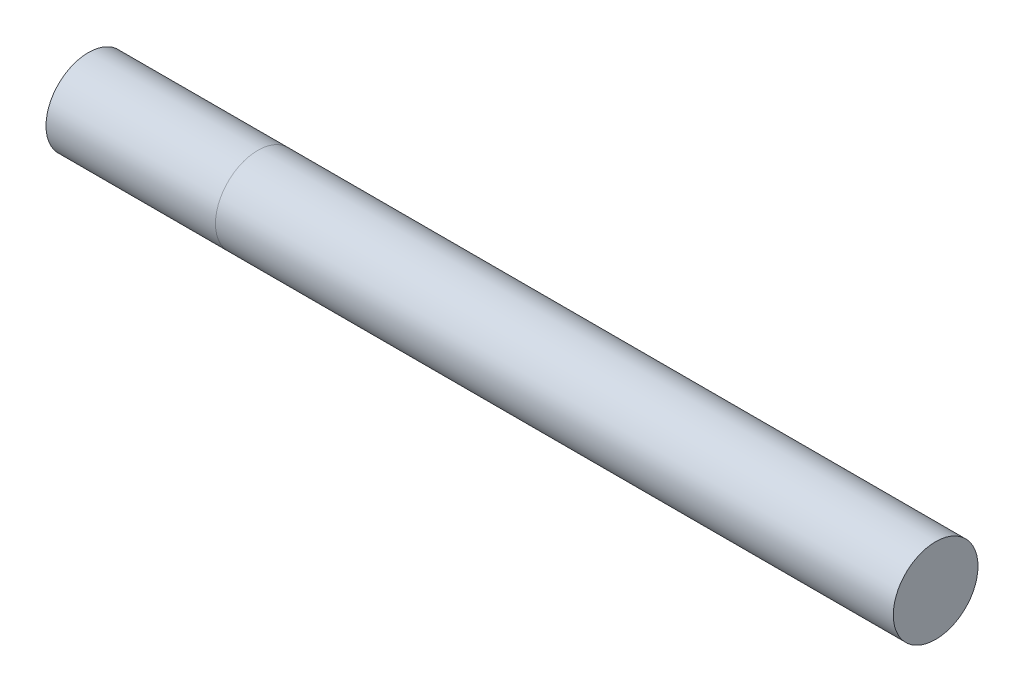
ISO-10303-21;
HEADER;
FILE_DESCRIPTION(('STEP AP214'),'2;1');
FILE_NAME('part.step','',(''),(''),'','','');
FILE_SCHEMA(('AUTOMOTIVE_DESIGN { 1 0 10303 214 1 1 1 1 }'));
ENDSEC;
DATA;
#1=APPLICATION_CONTEXT('core data for automotive mechanical design processes');
#2=APPLICATION_PROTOCOL_DEFINITION('international standard','automotive_design',2000,#1);
#3=PRODUCT_CONTEXT('',#1,'mechanical');
#4=PRODUCT('Part','Part','',(#3));
#5=PRODUCT_RELATED_PRODUCT_CATEGORY('part','',(#4));
#6=PRODUCT_DEFINITION_FORMATION('','',#4);
#7=PRODUCT_DEFINITION_CONTEXT('part definition',#1,'design');
#8=PRODUCT_DEFINITION('design','',#6,#7);
#9=PRODUCT_DEFINITION_SHAPE('','',#8);
#10=(LENGTH_UNIT() NAMED_UNIT(*) SI_UNIT(.MILLI.,.METRE.));
#11=(NAMED_UNIT(*) PLANE_ANGLE_UNIT() SI_UNIT($,.RADIAN.));
#12=(NAMED_UNIT(*) SI_UNIT($,.STERADIAN.) SOLID_ANGLE_UNIT());
#13=UNCERTAINTY_MEASURE_WITH_UNIT(LENGTH_MEASURE(1.E-05),#10,'distance_accuracy_value','');
#14=(GEOMETRIC_REPRESENTATION_CONTEXT(3) GLOBAL_UNCERTAINTY_ASSIGNED_CONTEXT((#13)) GLOBAL_UNIT_ASSIGNED_CONTEXT((#10,
#11,#12)) REPRESENTATION_CONTEXT('',''));
#15=CARTESIAN_POINT('',(0.,0.,0.));
#16=DIRECTION('',(0.,0.,1.));
#17=DIRECTION('',(1.,0.,0.));
#18=AXIS2_PLACEMENT_3D('',#15,#16,#17);
#19=CARTESIAN_POINT('',(250.,0.,0.));
#20=DIRECTION('',(-1.,0.,0.));
#21=DIRECTION('',(0.,0.,1.));
#22=AXIS2_PLACEMENT_3D('',#19,#20,#21);
#23=CYLINDRICAL_SURFACE('',#22,12.5);
#24=CARTESIAN_POINT('',(0.,0.,0.));
#25=DIRECTION('',(1.,0.,0.));
#26=DIRECTION('',(0.,0.,-1.));
#27=AXIS2_PLACEMENT_3D('',#24,#25,#26);
#28=CIRCLE('',#27,12.5);
#29=CARTESIAN_POINT('',(0.,0.,-12.5));
#30=VERTEX_POINT('',#29);
#31=EDGE_CURVE('E42',#30,#30,#28,.T.);
#32=ORIENTED_EDGE('',*,*,#31,.T.);
#33=EDGE_LOOP('',(#32));
#34=FACE_BOUND('',#33,.T.);
#35=CARTESIAN_POINT('',(50.,0.,0.));
#36=DIRECTION('',(-1.,0.,0.));
#37=DIRECTION('',(0.,0.,1.));
#38=AXIS2_PLACEMENT_3D('',#35,#36,#37);
#39=CIRCLE('',#38,12.5);
#40=CARTESIAN_POINT('',(50.,0.,12.5));
#41=VERTEX_POINT('',#40);
#42=EDGE_CURVE('E11',#41,#41,#39,.T.);
#43=ORIENTED_EDGE('',*,*,#42,.T.);
#44=EDGE_LOOP('',(#43));
#45=FACE_BOUND('',#44,.T.);
#46=ADVANCED_FACE('F31',(#34,#45),#23,.T.);
#47=ORIENTED_EDGE('',*,*,#42,.F.);
#48=EDGE_LOOP('',(#47));
#49=FACE_BOUND('',#48,.T.);
#50=CARTESIAN_POINT('',(250.,0.,0.));
#51=DIRECTION('',(1.,0.,0.));
#52=DIRECTION('',(0.,0.,-1.));
#53=AXIS2_PLACEMENT_3D('',#50,#51,#52);
#54=CIRCLE('',#53,12.5);
#55=CARTESIAN_POINT('',(250.,0.,-12.5));
#56=VERTEX_POINT('',#55);
#57=EDGE_CURVE('E38',#56,#56,#54,.T.);
#58=ORIENTED_EDGE('',*,*,#57,.F.);
#59=EDGE_LOOP('',(#58));
#60=FACE_BOUND('',#59,.T.);
#61=ADVANCED_FACE('F33',(#49,#60),#23,.T.);
#62=CARTESIAN_POINT('',(250.,0.,0.));
#63=DIRECTION('',(1.,0.,0.));
#64=DIRECTION('',(0.,0.,-1.));
#65=AXIS2_PLACEMENT_3D('',#62,#63,#64);
#66=PLANE('',#65);
#67=ORIENTED_EDGE('',*,*,#57,.T.);
#68=EDGE_LOOP('',(#67));
#69=FACE_BOUND('',#68,.T.);
#70=ADVANCED_FACE('F52',(#69),#66,.T.);
#71=CARTESIAN_POINT('',(0.,0.,0.));
#72=DIRECTION('',(1.,0.,0.));
#73=DIRECTION('',(0.,0.,-1.));
#74=AXIS2_PLACEMENT_3D('',#71,#72,#73);
#75=PLANE('',#74);
#76=ORIENTED_EDGE('',*,*,#31,.F.);
#77=EDGE_LOOP('',(#76));
#78=FACE_BOUND('',#77,.T.);
#79=ADVANCED_FACE('F50',(#78),#75,.F.);
#80=CLOSED_SHELL('',(#46,#61,#70,#79));
#81=MANIFOLD_SOLID_BREP('B2',#80);
#82=ADVANCED_BREP_SHAPE_REPRESENTATION('',(#18,#81),#14);
#83=SHAPE_DEFINITION_REPRESENTATION(#9,#82);
ENDSEC;
END-ISO-10303-21;
